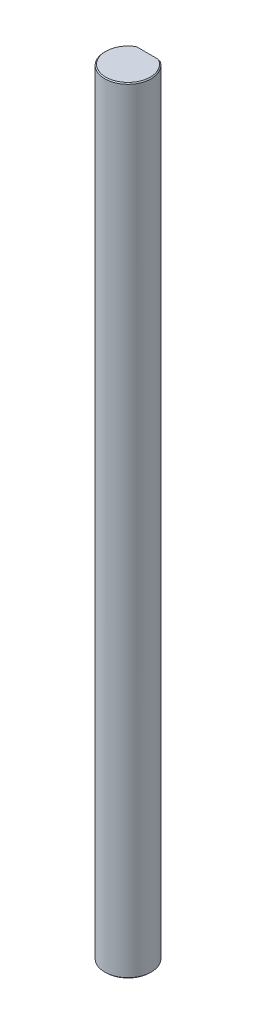
ISO-10303-21;
HEADER;
FILE_DESCRIPTION(('STEP AP214'),'2;1');
FILE_NAME('part.step','',(''),(''),'','','');
FILE_SCHEMA(('AUTOMOTIVE_DESIGN { 1 0 10303 214 1 1 1 1 }'));
ENDSEC;
DATA;
#1=APPLICATION_CONTEXT('core data for automotive mechanical design processes');
#2=APPLICATION_PROTOCOL_DEFINITION('international standard','automotive_design',2000,#1);
#3=PRODUCT_CONTEXT('',#1,'mechanical');
#4=PRODUCT('Part','Part','',(#3));
#5=PRODUCT_RELATED_PRODUCT_CATEGORY('part','',(#4));
#6=PRODUCT_DEFINITION_FORMATION('','',#4);
#7=PRODUCT_DEFINITION_CONTEXT('part definition',#1,'design');
#8=PRODUCT_DEFINITION('design','',#6,#7);
#9=PRODUCT_DEFINITION_SHAPE('','',#8);
#10=(LENGTH_UNIT() NAMED_UNIT(*) SI_UNIT(.MILLI.,.METRE.));
#11=(NAMED_UNIT(*) PLANE_ANGLE_UNIT() SI_UNIT($,.RADIAN.));
#12=(NAMED_UNIT(*) SI_UNIT($,.STERADIAN.) SOLID_ANGLE_UNIT());
#13=UNCERTAINTY_MEASURE_WITH_UNIT(LENGTH_MEASURE(1.E-05),#10,'distance_accuracy_value','');
#14=(GEOMETRIC_REPRESENTATION_CONTEXT(3) GLOBAL_UNCERTAINTY_ASSIGNED_CONTEXT((#13)) GLOBAL_UNIT_ASSIGNED_CONTEXT((#10,
#11,#12)) REPRESENTATION_CONTEXT('',''));
#15=CARTESIAN_POINT('',(0.,0.,0.));
#16=DIRECTION('',(0.,0.,1.));
#17=DIRECTION('',(1.,0.,0.));
#18=AXIS2_PLACEMENT_3D('',#15,#16,#17);
#19=CARTESIAN_POINT('',(0.,100.,0.));
#20=DIRECTION('',(0.,-1.,0.));
#21=DIRECTION('',(0.,0.,-1.));
#22=AXIS2_PLACEMENT_3D('',#19,#20,#21);
#23=CONICAL_SURFACE('',#22,2.875,0.785398163397384);
#24=CARTESIAN_POINT('',(-1.6583123951777,99.875,-2.5));
#25=CARTESIAN_POINT('',(-1.57973572193477,99.9184348904035,-2.5));
#26=CARTESIAN_POINT('',(-1.50022900034242,99.9602466964647,-2.5));
#27=CARTESIAN_POINT('',(-1.4197270864501,100.,-2.5));
#28=(BOUNDED_CURVE() B_SPLINE_CURVE(3,(#24,#25,#26,#27),.UNSPECIFIED.,.F.,
.F.) B_SPLINE_CURVE_WITH_KNOTS((4,4),(0.,0.000269347265701072),
.UNSPECIFIED.) CURVE() GEOMETRIC_REPRESENTATION_ITEM() RATIONAL_B_SPLINE_CURVE((1.,1.,1.,1.)) REPRESENTATION_ITEM(''));
#29=CARTESIAN_POINT('',(-1.6583123951777,99.875,-2.5));
#30=VERTEX_POINT('',#29);
#31=CARTESIAN_POINT('',(-1.4197270864501,100.,-2.5));
#32=VERTEX_POINT('',#31);
#33=EDGE_CURVE('E82',#30,#32,#28,.T.);
#34=ORIENTED_EDGE('',*,*,#33,.F.);
#35=CARTESIAN_POINT('',(0.,99.875,0.));
#36=DIRECTION('',(0.,-1.,0.));
#37=DIRECTION('',(0.,0.,1.));
#38=AXIS2_PLACEMENT_3D('',#35,#36,#37);
#39=CIRCLE('',#38,3.);
#40=CARTESIAN_POINT('',(1.6583123951777,99.875,-2.5));
#41=VERTEX_POINT('',#40);
#42=EDGE_CURVE('E84',#41,#30,#39,.T.);
#43=ORIENTED_EDGE('',*,*,#42,.F.);
#44=CARTESIAN_POINT('',(1.4197270864501,100.,-2.5));
#45=CARTESIAN_POINT('',(1.50022900034241,99.9602466964647,-2.5));
#46=CARTESIAN_POINT('',(1.57973572193477,99.9184348904036,-2.5));
#47=CARTESIAN_POINT('',(1.6583123951777,99.875,-2.5));
#48=(BOUNDED_CURVE() B_SPLINE_CURVE(3,(#44,#45,#46,#47),.UNSPECIFIED.,.F.,
.F.) B_SPLINE_CURVE_WITH_KNOTS((4,4),(0.,0.00026934726570107),
.UNSPECIFIED.) CURVE() GEOMETRIC_REPRESENTATION_ITEM() RATIONAL_B_SPLINE_CURVE((1.,1.,1.,1.)) REPRESENTATION_ITEM(''));
#49=CARTESIAN_POINT('',(1.4197270864501,100.,-2.5));
#50=VERTEX_POINT('',#49);
#51=EDGE_CURVE('E119',#50,#41,#48,.T.);
#52=ORIENTED_EDGE('',*,*,#51,.F.);
#53=CARTESIAN_POINT('',(0.,100.,0.));
#54=DIRECTION('',(0.,1.,0.));
#55=DIRECTION('',(0.,0.,1.));
#56=AXIS2_PLACEMENT_3D('',#53,#54,#55);
#57=CIRCLE('',#56,2.875);
#58=EDGE_CURVE('E26',#32,#50,#57,.T.);
#59=ORIENTED_EDGE('',*,*,#58,.F.);
#60=EDGE_LOOP('',(#34,#43,#52,#59));
#61=FACE_BOUND('',#60,.T.);
#62=ADVANCED_FACE('F15',(#61),#23,.T.);
#63=CARTESIAN_POINT('',(0.,0.124999999999972,0.));
#64=DIRECTION('',(0.,1.,0.));
#65=DIRECTION('',(0.,0.,1.));
#66=AXIS2_PLACEMENT_3D('',#63,#64,#65);
#67=CONICAL_SURFACE('',#66,3.,0.785398163397493);
#68=DIRECTION('',(0.,0.707106781186516,0.707106781186579));
#69=VECTOR('',#68,1.);
#70=CARTESIAN_POINT('',(0.,0.124999999999972,3.));
#71=LINE('',#70,#69);
#72=CARTESIAN_POINT('',(0.,0.,2.875));
#73=VERTEX_POINT('',#72);
#74=CARTESIAN_POINT('',(0.,0.124999999999972,3.));
#75=VERTEX_POINT('',#74);
#76=EDGE_CURVE('E131',#73,#75,#71,.T.);
#77=ORIENTED_EDGE('',*,*,#76,.F.);
#78=CARTESIAN_POINT('',(0.,0.,0.));
#79=DIRECTION('',(0.,-1.,0.));
#80=DIRECTION('',(0.,0.,1.));
#81=AXIS2_PLACEMENT_3D('',#78,#79,#80);
#82=CIRCLE('',#81,2.875);
#83=CARTESIAN_POINT('',(1.4197270864501,0.,-2.5));
#84=VERTEX_POINT('',#83);
#85=EDGE_CURVE('E10',#84,#73,#82,.T.);
#86=ORIENTED_EDGE('',*,*,#85,.F.);
#87=CARTESIAN_POINT('',(1.6583123951777,0.124999999999972,-2.5));
#88=CARTESIAN_POINT('',(1.57973572193477,0.0815651095964483,-2.5));
#89=CARTESIAN_POINT('',(1.50022900034242,0.0397533035352685,-2.5));
#90=CARTESIAN_POINT('',(1.4197270864501,0.,-2.5));
#91=(BOUNDED_CURVE() B_SPLINE_CURVE(3,(#87,#88,#89,#90),.UNSPECIFIED.,.F.,
.F.) B_SPLINE_CURVE_WITH_KNOTS((4,4),(0.,0.000269347265701057),
.UNSPECIFIED.) CURVE() GEOMETRIC_REPRESENTATION_ITEM() RATIONAL_B_SPLINE_CURVE((1.,1.,1.,1.)) REPRESENTATION_ITEM(''));
#92=CARTESIAN_POINT('',(1.6583123951777,0.124999999999972,-2.5));
#93=VERTEX_POINT('',#92);
#94=EDGE_CURVE('E73',#93,#84,#91,.T.);
#95=ORIENTED_EDGE('',*,*,#94,.F.);
#96=CARTESIAN_POINT('',(0.,0.124999999999972,0.));
#97=DIRECTION('',(0.,1.,0.));
#98=DIRECTION('',(0.,0.,1.));
#99=AXIS2_PLACEMENT_3D('',#96,#97,#98);
#100=CIRCLE('',#99,3.);
#101=EDGE_CURVE('E106',#75,#93,#100,.T.);
#102=ORIENTED_EDGE('',*,*,#101,.F.);
#103=EDGE_LOOP('',(#77,#86,#95,#102));
#104=FACE_BOUND('',#103,.T.);
#105=ADVANCED_FACE('F17',(#104),#67,.T.);
#106=CARTESIAN_POINT('',(0.,0.,0.));
#107=DIRECTION('',(0.,1.,0.));
#108=DIRECTION('',(1.,0.,0.));
#109=AXIS2_PLACEMENT_3D('',#106,#107,#108);
#110=PLANE('',#109);
#111=DIRECTION('',(1.,0.,0.));
#112=VECTOR('',#111,1.);
#113=CARTESIAN_POINT('',(0.,0.,-2.5));
#114=LINE('',#113,#112);
#115=CARTESIAN_POINT('',(-1.4197270864501,0.,-2.5));
#116=VERTEX_POINT('',#115);
#117=EDGE_CURVE('E19',#116,#84,#114,.T.);
#118=ORIENTED_EDGE('',*,*,#117,.T.);
#119=ORIENTED_EDGE('',*,*,#85,.T.);
#120=CARTESIAN_POINT('',(0.,0.,0.));
#121=DIRECTION('',(0.,-1.,0.));
#122=DIRECTION('',(0.,0.,1.));
#123=AXIS2_PLACEMENT_3D('',#120,#121,#122);
#124=CIRCLE('',#123,2.875);
#125=EDGE_CURVE('E127',#73,#116,#124,.T.);
#126=ORIENTED_EDGE('',*,*,#125,.T.);
#127=EDGE_LOOP('',(#118,#119,#126));
#128=FACE_BOUND('',#127,.T.);
#129=ADVANCED_FACE('F146',(#128),#110,.F.);
#130=CARTESIAN_POINT('',(0.,100.,0.));
#131=DIRECTION('',(0.,1.,0.));
#132=DIRECTION('',(1.,0.,0.));
#133=AXIS2_PLACEMENT_3D('',#130,#131,#132);
#134=PLANE('',#133);
#135=DIRECTION('',(1.,0.,0.));
#136=VECTOR('',#135,1.);
#137=CARTESIAN_POINT('',(0.,100.,-2.5));
#138=LINE('',#137,#136);
#139=EDGE_CURVE('E90',#32,#50,#138,.T.);
#140=ORIENTED_EDGE('',*,*,#139,.F.);
#141=ORIENTED_EDGE('',*,*,#58,.T.);
#142=EDGE_LOOP('',(#140,#141));
#143=FACE_BOUND('',#142,.T.);
#144=ADVANCED_FACE('F169',(#143),#134,.T.);
#145=CARTESIAN_POINT('',(0.,100.,-2.5));
#146=DIRECTION('',(0.,0.,-1.));
#147=DIRECTION('',(0.,-1.,0.));
#148=AXIS2_PLACEMENT_3D('',#145,#146,#147);
#149=PLANE('',#148);
#150=DIRECTION('',(0.,-1.,0.));
#151=VECTOR('',#150,1.);
#152=CARTESIAN_POINT('',(1.6583123951777,100.,-2.5));
#153=LINE('',#152,#151);
#154=EDGE_CURVE('E98',#41,#93,#153,.T.);
#155=ORIENTED_EDGE('',*,*,#154,.T.);
#156=ORIENTED_EDGE('',*,*,#94,.T.);
#157=ORIENTED_EDGE('',*,*,#117,.F.);
#158=CARTESIAN_POINT('',(-1.4197270864501,0.,-2.5));
#159=CARTESIAN_POINT('',(-1.50022900034241,0.0397533035352923,-2.5));
#160=CARTESIAN_POINT('',(-1.57973572193477,0.081565109596436,-2.5));
#161=CARTESIAN_POINT('',(-1.6583123951777,0.124999999999972,-2.5));
#162=(BOUNDED_CURVE() B_SPLINE_CURVE(3,(#158,#159,#160,#161),.UNSPECIFIED.,.F.,
.F.) B_SPLINE_CURVE_WITH_KNOTS((4,4),(0.,0.000269347265701057),
.UNSPECIFIED.) CURVE() GEOMETRIC_REPRESENTATION_ITEM() RATIONAL_B_SPLINE_CURVE((1.,1.,1.,1.)) REPRESENTATION_ITEM(''));
#163=CARTESIAN_POINT('',(-1.6583123951777,0.124999999999972,-2.5));
#164=VERTEX_POINT('',#163);
#165=EDGE_CURVE('E103',#116,#164,#162,.T.);
#166=ORIENTED_EDGE('',*,*,#165,.T.);
#167=DIRECTION('',(0.,-1.,0.));
#168=VECTOR('',#167,1.);
#169=CARTESIAN_POINT('',(-1.6583123951777,100.,-2.5));
#170=LINE('',#169,#168);
#171=EDGE_CURVE('E95',#30,#164,#170,.T.);
#172=ORIENTED_EDGE('',*,*,#171,.F.);
#173=ORIENTED_EDGE('',*,*,#33,.T.);
#174=ORIENTED_EDGE('',*,*,#139,.T.);
#175=ORIENTED_EDGE('',*,*,#51,.T.);
#176=EDGE_LOOP('',(#155,#156,#157,#166,#172,#173,#174,#175));
#177=FACE_BOUND('',#176,.T.);
#178=ADVANCED_FACE('F101',(#177),#149,.T.);
#179=CARTESIAN_POINT('',(0.,100.,0.));
#180=DIRECTION('',(0.,-1.,0.));
#181=DIRECTION('',(0.,0.,-1.));
#182=AXIS2_PLACEMENT_3D('',#179,#180,#181);
#183=CYLINDRICAL_SURFACE('',#182,3.);
#184=ORIENTED_EDGE('',*,*,#171,.T.);
#185=CARTESIAN_POINT('',(0.,0.124999999999972,0.));
#186=DIRECTION('',(0.,1.,0.));
#187=DIRECTION('',(0.,0.,1.));
#188=AXIS2_PLACEMENT_3D('',#185,#186,#187);
#189=CIRCLE('',#188,3.);
#190=EDGE_CURVE('E114',#164,#75,#189,.T.);
#191=ORIENTED_EDGE('',*,*,#190,.T.);
#192=ORIENTED_EDGE('',*,*,#101,.T.);
#193=ORIENTED_EDGE('',*,*,#154,.F.);
#194=ORIENTED_EDGE('',*,*,#42,.T.);
#195=EDGE_LOOP('',(#184,#191,#192,#193,#194));
#196=FACE_BOUND('',#195,.T.);
#197=ADVANCED_FACE('F93',(#196),#183,.T.);
#198=CARTESIAN_POINT('',(0.,0.124999999999972,0.));
#199=DIRECTION('',(0.,1.,0.));
#200=DIRECTION('',(0.,0.,1.));
#201=AXIS2_PLACEMENT_3D('',#198,#199,#200);
#202=CONICAL_SURFACE('',#201,3.,0.785398163397493);
#203=ORIENTED_EDGE('',*,*,#125,.F.);
#204=ORIENTED_EDGE('',*,*,#76,.T.);
#205=ORIENTED_EDGE('',*,*,#190,.F.);
#206=ORIENTED_EDGE('',*,*,#165,.F.);
#207=EDGE_LOOP('',(#203,#204,#205,#206));
#208=FACE_BOUND('',#207,.T.);
#209=ADVANCED_FACE('F143',(#208),#202,.T.);
#210=CLOSED_SHELL('',(#62,#105,#129,#144,#178,#197,#209));
#211=MANIFOLD_SOLID_BREP('B1',#210);
#212=ADVANCED_BREP_SHAPE_REPRESENTATION('',(#18,#211),#14);
#213=SHAPE_DEFINITION_REPRESENTATION(#9,#212);
ENDSEC;
END-ISO-10303-21;
